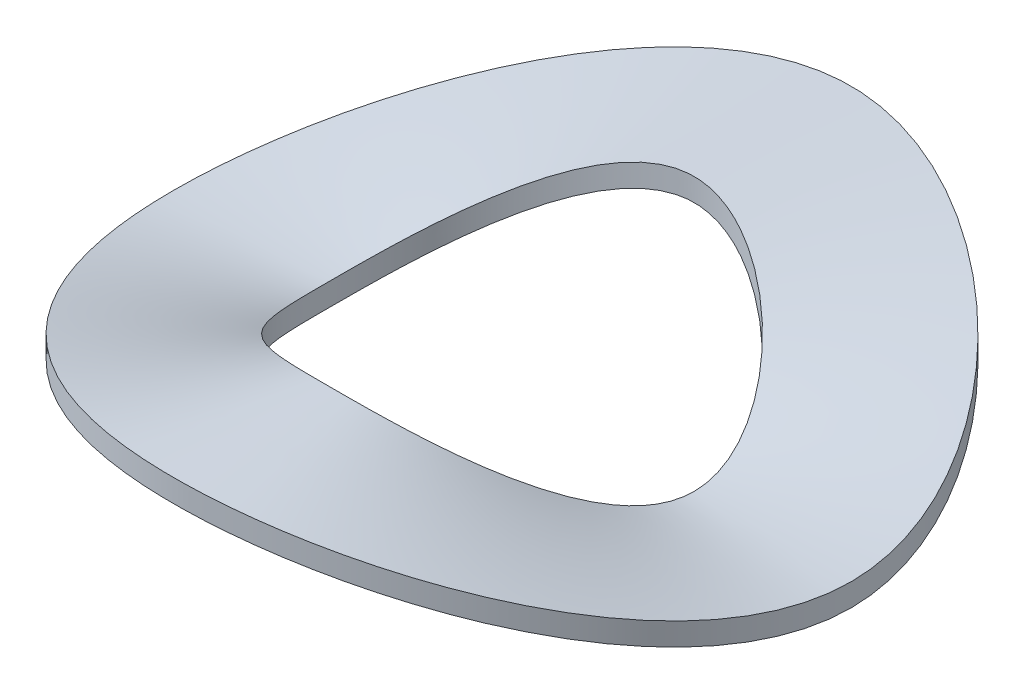
ISO-10303-21;
HEADER;
FILE_DESCRIPTION(('STEP AP214'),'2;1');
FILE_NAME('part.step','',(''),(''),'','','');
FILE_SCHEMA(('AUTOMOTIVE_DESIGN { 1 0 10303 214 1 1 1 1 }'));
ENDSEC;
DATA;
#1=APPLICATION_CONTEXT('core data for automotive mechanical design processes');
#2=APPLICATION_PROTOCOL_DEFINITION('international standard','automotive_design',2000,#1);
#3=PRODUCT_CONTEXT('',#1,'mechanical');
#4=PRODUCT('Part','Part','',(#3));
#5=PRODUCT_RELATED_PRODUCT_CATEGORY('part','',(#4));
#6=PRODUCT_DEFINITION_FORMATION('','',#4);
#7=PRODUCT_DEFINITION_CONTEXT('part definition',#1,'design');
#8=PRODUCT_DEFINITION('design','',#6,#7);
#9=PRODUCT_DEFINITION_SHAPE('','',#8);
#10=(LENGTH_UNIT() NAMED_UNIT(*) SI_UNIT(.MILLI.,.METRE.));
#11=(NAMED_UNIT(*) PLANE_ANGLE_UNIT() SI_UNIT($,.RADIAN.));
#12=(NAMED_UNIT(*) SI_UNIT($,.STERADIAN.) SOLID_ANGLE_UNIT());
#13=UNCERTAINTY_MEASURE_WITH_UNIT(LENGTH_MEASURE(1.E-05),#10,'distance_accuracy_value','');
#14=(GEOMETRIC_REPRESENTATION_CONTEXT(3) GLOBAL_UNCERTAINTY_ASSIGNED_CONTEXT((#13)) GLOBAL_UNIT_ASSIGNED_CONTEXT((#10,
#11,#12)) REPRESENTATION_CONTEXT('',''));
#15=CARTESIAN_POINT('',(0.,0.,0.));
#16=DIRECTION('',(0.,0.,1.));
#17=DIRECTION('',(1.,0.,0.));
#18=AXIS2_PLACEMENT_3D('',#15,#16,#17);
#19=CARTESIAN_POINT('',(-2.4511,0.304799999999994,0.));
#20=CARTESIAN_POINT('',(-2.45109999999954,0.304800000000202,-0.0612774999996929));
#21=CARTESIAN_POINT('',(-2.4449722499989,0.310896000000518,-0.183832499999086));
#22=CARTESIAN_POINT('',(-2.41831653749869,0.336499200000742,-0.366745837498236));
#23=CARTESIAN_POINT('',(-2.37511589999916,0.376732800000765,-0.547820849997448));
#24=CARTESIAN_POINT('',(-2.02215750000165,0.694944000003361,-1.61772600000511));
#25=CARTESIAN_POINT('',(0.245109999948093,2.49935999999959,-3.43153999999938));
#26=CARTESIAN_POINT('',(3.67665000001852,-0.91439999998158,-1.53592416562987E-11));
#27=CARTESIAN_POINT('',(0.245109999918596,2.49936000000041,3.43153999999816));
#28=CARTESIAN_POINT('',(-2.02215750002205,0.694943999996631,1.61772600001525));
#29=CARTESIAN_POINT('',(-2.3751159000074,0.37673279999717,0.547820849997112));
#30=CARTESIAN_POINT('',(-2.4183165375042,0.336499199998314,0.366745837498086));
#31=CARTESIAN_POINT('',(-2.44497225000166,0.310895999999297,0.183832499999058));
#32=CARTESIAN_POINT('',(-2.45110000000046,0.3047999999998,0.0612774999996929));
#33=CARTESIAN_POINT('',(-2.4511,0.304799999999994,0.));
#34=CARTESIAN_POINT('',(-2.4511,0.279399999999999,0.));
#35=CARTESIAN_POINT('',(-2.45109999999954,0.279400000000207,-0.0612774999996929));
#36=CARTESIAN_POINT('',(-2.4449722499989,0.285496000000524,-0.183832499999086));
#37=CARTESIAN_POINT('',(-2.41831653749869,0.311099200000747,-0.366745837498236));
#38=CARTESIAN_POINT('',(-2.37511589999916,0.35133280000077,-0.547820849997448));
#39=CARTESIAN_POINT('',(-2.02215750000165,0.669544000003366,-1.61772600000511));
#40=CARTESIAN_POINT('',(0.245109999948093,2.47395999999959,-3.43153999999938));
#41=CARTESIAN_POINT('',(3.67665000001852,-0.939799999981575,-1.53592416562987E-11));
#42=CARTESIAN_POINT('',(0.245109999918596,2.47396000000041,3.43153999999816));
#43=CARTESIAN_POINT('',(-2.02215750002205,0.669543999996636,1.61772600001525));
#44=CARTESIAN_POINT('',(-2.3751159000074,0.351332799997175,0.547820849997112));
#45=CARTESIAN_POINT('',(-2.4183165375042,0.311099199998319,0.366745837498086));
#46=CARTESIAN_POINT('',(-2.44497225000166,0.285495999999302,0.183832499999058));
#47=CARTESIAN_POINT('',(-2.45110000000046,0.279399999999791,0.0612774999996929));
#48=CARTESIAN_POINT('',(-2.4511,0.279399999999999,0.));
#49=CARTESIAN_POINT('',(-2.4511,0.228599999999995,0.));
#50=CARTESIAN_POINT('',(-2.45109999999955,0.228600000000204,-0.0612774999996929));
#51=CARTESIAN_POINT('',(-2.4449722499989,0.23469600000052,-0.183832499999086));
#52=CARTESIAN_POINT('',(-2.41831653749869,0.260299200000744,-0.366745837498236));
#53=CARTESIAN_POINT('',(-2.37511589999916,0.300532800000766,-0.547820849997452));
#54=CARTESIAN_POINT('',(-2.02215750000165,0.618744000003363,-1.61772600000511));
#55=CARTESIAN_POINT('',(0.245109999948093,2.42315999999959,-3.43153999999938));
#56=CARTESIAN_POINT('',(3.67665000001852,-0.990599999981578,-1.53592416562987E-11));
#57=CARTESIAN_POINT('',(0.245109999918596,2.42316000000041,3.43153999999817));
#58=CARTESIAN_POINT('',(-2.02215750002206,0.618743999996632,1.61772600001526));
#59=CARTESIAN_POINT('',(-2.3751159000074,0.300532799997172,0.547820849997112));
#60=CARTESIAN_POINT('',(-2.4183165375042,0.260299199998315,0.366745837498086));
#61=CARTESIAN_POINT('',(-2.44497225000166,0.234695999999299,0.183832499999058));
#62=CARTESIAN_POINT('',(-2.45110000000047,0.228599999999801,0.0612774999996929));
#63=CARTESIAN_POINT('',(-2.4511,0.228599999999995,0.));
#64=CARTESIAN_POINT('',(-2.4511,0.152399999999997,0.));
#65=CARTESIAN_POINT('',(-2.45109999999954,0.152400000000205,-0.0612774999996929));
#66=CARTESIAN_POINT('',(-2.44497224999889,0.158496000000521,-0.183832499999086));
#67=CARTESIAN_POINT('',(-2.41831653749869,0.184099200000745,-0.366745837498236));
#68=CARTESIAN_POINT('',(-2.37511589999916,0.224332800000768,-0.547820849997448));
#69=CARTESIAN_POINT('',(-2.02215750000165,0.542544000003364,-1.61772600000511));
#70=CARTESIAN_POINT('',(0.245109999948093,2.34695999999959,-3.43153999999937));
#71=CARTESIAN_POINT('',(3.67665000001852,-1.06679999998158,-1.53592416562987E-11));
#72=CARTESIAN_POINT('',(0.245109999918596,2.34696000000041,3.43153999999815));
#73=CARTESIAN_POINT('',(-2.02215750002205,0.542543999996634,1.61772600001525));
#74=CARTESIAN_POINT('',(-2.37511590000739,0.224332799997173,0.547820849997112));
#75=CARTESIAN_POINT('',(-2.4183165375042,0.184099199998317,0.366745837498079));
#76=CARTESIAN_POINT('',(-2.44497225000166,0.1584959999993,0.183832499999058));
#77=CARTESIAN_POINT('',(-2.45110000000046,0.152399999999803,0.0612774999996929));
#78=CARTESIAN_POINT('',(-2.4511,0.152399999999997,0.));
#79=CARTESIAN_POINT('',(-2.4511,0.0761999999999985,0.));
#80=CARTESIAN_POINT('',(-2.45109999999955,0.0762000000002067,-0.0612774999996929));
#81=CARTESIAN_POINT('',(-2.4449722499989,0.082296000000523,-0.183832499999086));
#82=CARTESIAN_POINT('',(-2.41831653749869,0.107899200000747,-0.366745837498236));
#83=CARTESIAN_POINT('',(-2.37511589999916,0.148132800000769,-0.547820849997452));
#84=CARTESIAN_POINT('',(-2.02215750000165,0.466344000003366,-1.61772600000511));
#85=CARTESIAN_POINT('',(0.245109999948093,2.27075999999959,-3.43153999999938));
#86=CARTESIAN_POINT('',(3.67665000001852,-1.14299999998158,-1.53592416562987E-11));
#87=CARTESIAN_POINT('',(0.245109999918596,2.27076000000041,3.43153999999817));
#88=CARTESIAN_POINT('',(-2.02215750002206,0.466343999996635,1.61772600001526));
#89=CARTESIAN_POINT('',(-2.3751159000074,0.148132799997175,0.547820849997112));
#90=CARTESIAN_POINT('',(-2.4183165375042,0.107899199998318,0.366745837498086));
#91=CARTESIAN_POINT('',(-2.44497225000166,0.0822959999993017,0.183832499999058));
#92=CARTESIAN_POINT('',(-2.45110000000047,0.0761999999997903,0.0612774999996929));
#93=CARTESIAN_POINT('',(-2.4511,0.0761999999999985,0.));
#94=CARTESIAN_POINT('',(-2.4511,0.0253999999999949,0.));
#95=CARTESIAN_POINT('',(-2.45109999999954,0.025400000000203,-0.0612774999996929));
#96=CARTESIAN_POINT('',(-2.4449722499989,0.0314960000005193,-0.183832499999086));
#97=CARTESIAN_POINT('',(-2.41831653749869,0.0570992000007431,-0.366745837498236));
#98=CARTESIAN_POINT('',(-2.37511589999916,0.0973328000007656,-0.547820849997448));
#99=CARTESIAN_POINT('',(-2.02215750000165,0.415544000003362,-1.61772600000511));
#100=CARTESIAN_POINT('',(0.245109999948093,2.21995999999959,-3.43153999999938));
#101=CARTESIAN_POINT('',(3.67665000001852,-1.19379999998158,-1.53592416562987E-11));
#102=CARTESIAN_POINT('',(0.245109999918596,2.21996000000041,3.43153999999816));
#103=CARTESIAN_POINT('',(-2.02215750002205,0.415543999996631,1.61772600001525));
#104=CARTESIAN_POINT('',(-2.3751159000074,0.0973327999971713,0.547820849997112));
#105=CARTESIAN_POINT('',(-2.4183165375042,0.0570991999983284,0.366745837498086));
#106=CARTESIAN_POINT('',(-2.44497225000166,0.0314959999992981,0.183832499999058));
#107=CARTESIAN_POINT('',(-2.45110000000046,0.0253999999998006,0.0612774999996929));
#108=CARTESIAN_POINT('',(-2.4511,0.0253999999999949,0.));
#109=CARTESIAN_POINT('',(-2.4511,0.,0.));
#110=CARTESIAN_POINT('',(-2.45109999999954,2.08166817117217E-13,-0.0612774999996929));
#111=CARTESIAN_POINT('',(-2.4449722499989,0.00609600000052446,-0.183832499999086));
#112=CARTESIAN_POINT('',(-2.41831653749869,0.0316992000007482,-0.366745837498236));
#113=CARTESIAN_POINT('',(-2.37511589999916,0.0719328000007707,-0.547820849997448));
#114=CARTESIAN_POINT('',(-2.02215750000165,0.390144000003367,-1.61772600000511));
#115=CARTESIAN_POINT('',(0.245109999948093,2.1945599999996,-3.43153999999938));
#116=CARTESIAN_POINT('',(3.67665000001852,-1.21919999998157,-1.53592416562987E-11));
#117=CARTESIAN_POINT('',(0.245109999918596,2.19456000000041,3.43153999999816));
#118=CARTESIAN_POINT('',(-2.02215750002205,0.390143999996637,1.61772600001525));
#119=CARTESIAN_POINT('',(-2.3751159000074,0.0719327999971764,0.547820849997112));
#120=CARTESIAN_POINT('',(-2.4183165375042,0.0316991999983196,0.366745837498086));
#121=CARTESIAN_POINT('',(-2.44497225000166,0.00609599999928934,0.183832499999058));
#122=CARTESIAN_POINT('',(-2.45110000000046,-2.08166817117217E-13,0.0612774999996929));
#123=CARTESIAN_POINT('',(-2.4511,0.,0.));
#124=B_SPLINE_SURFACE_WITH_KNOTS('',3,3,((#19,#20,#21,#22,#23,#24,#25,#26,#27,#28,#29,#30,#31,
#32,#33),(#34,#35,#36,#37,#38,#39,#40,#41,#42,#43,#44,#45,#46,#47,#48),(#49,#50,#51,#52,#53,#54,
#55,#56,#57,#58,#59,#60,#61,#62,#63),(#64,#65,#66,#67,#68,#69,#70,#71,#72,#73,#74,#75,#76,#77,
#78),(#79,#80,#81,#82,#83,#84,#85,#86,#87,#88,#89,#90,#91,#92,#93),(#94,#95,#96,#97,#98,#99,
#100,#101,#102,#103,#104,#105,#106,#107,#108),(#109,#110,#111,#112,#113,#114,#115,#116,#117,
#118,#119,#120,#121,#122,#123)),.UNSPECIFIED.,.F.,.T.,.F.,(4,1,1,1,4),(4,1,1,1,1,1,1,1,1,1,1,1,
4),(0.88785046728972,0.91588785046729,0.94392523364486,0.97196261682243,1.),(0.,0.0125,
0.0249999999999999,0.0375000000000001,0.05,0.250000000002523,0.5,0.749999999994969,0.95,0.9625,
0.975,0.9875,1.),.UNSPECIFIED.);
#125=CARTESIAN_POINT('',(-2.4511,0.,0.));
#126=CARTESIAN_POINT('',(-2.45109999999954,2.08166817117217E-13,-0.0612774999996929));
#127=CARTESIAN_POINT('',(-2.4449722499989,0.00609600000052446,-0.183832499999086));
#128=CARTESIAN_POINT('',(-2.41831653749869,0.0316992000007482,-0.366745837498236));
#129=CARTESIAN_POINT('',(-2.37511589999916,0.0719328000007707,-0.547820849997448));
#130=CARTESIAN_POINT('',(-2.02215750000165,0.390144000003367,-1.61772600000511));
#131=CARTESIAN_POINT('',(0.245109999948093,2.1945599999996,-3.43153999999938));
#132=CARTESIAN_POINT('',(3.67665000001852,-1.21919999998157,-1.53592416562987E-11));
#133=CARTESIAN_POINT('',(0.245109999918596,2.19456000000041,3.43153999999816));
#134=CARTESIAN_POINT('',(-2.02215750002205,0.390143999996637,1.61772600001525));
#135=CARTESIAN_POINT('',(-2.3751159000074,0.0719327999971764,0.547820849997112));
#136=CARTESIAN_POINT('',(-2.4183165375042,0.0316991999983196,0.366745837498086));
#137=CARTESIAN_POINT('',(-2.44497225000166,0.00609599999928934,0.183832499999058));
#138=CARTESIAN_POINT('',(-2.45110000000046,-2.08166817117217E-13,0.0612774999996929));
#139=CARTESIAN_POINT('',(-2.4511,0.,0.));
#140=B_SPLINE_CURVE_WITH_KNOTS('',3,(#125,#126,#127,#128,#129,#130,#131,#132,#133,#134,#135,
#136,#137,#138,#139),.UNSPECIFIED.,.T.,.F.,(4,1,1,1,1,1,1,1,1,1,1,1,4),(0.,0.0125,
0.0249999999999999,0.0375000000000001,0.05,0.250000000002523,0.5,0.749999999994969,0.95,0.9625,
0.975,0.9875,1.),.UNSPECIFIED.);
#141=CARTESIAN_POINT('',(-2.4511,0.,0.));
#142=VERTEX_POINT('',#141);
#143=EDGE_CURVE('E13',#142,#142,#140,.T.);
#144=CARTESIAN_POINT('',(-2.4511,0.304799999999994,0.));
#145=CARTESIAN_POINT('',(-2.45109999999954,0.304800000000202,-0.0612774999996929));
#146=CARTESIAN_POINT('',(-2.4449722499989,0.310896000000518,-0.183832499999086));
#147=CARTESIAN_POINT('',(-2.41831653749869,0.336499200000742,-0.366745837498236));
#148=CARTESIAN_POINT('',(-2.37511589999916,0.376732800000765,-0.547820849997448));
#149=CARTESIAN_POINT('',(-2.02215750000165,0.694944000003361,-1.61772600000511));
#150=CARTESIAN_POINT('',(0.245109999948093,2.49935999999959,-3.43153999999938));
#151=CARTESIAN_POINT('',(3.67665000001852,-0.91439999998158,-1.53592416562987E-11));
#152=CARTESIAN_POINT('',(0.245109999918596,2.49936000000041,3.43153999999816));
#153=CARTESIAN_POINT('',(-2.02215750002205,0.694943999996631,1.61772600001525));
#154=CARTESIAN_POINT('',(-2.3751159000074,0.37673279999717,0.547820849997112));
#155=CARTESIAN_POINT('',(-2.4183165375042,0.336499199998314,0.366745837498086));
#156=CARTESIAN_POINT('',(-2.44497225000166,0.310895999999297,0.183832499999058));
#157=CARTESIAN_POINT('',(-2.45110000000046,0.3047999999998,0.0612774999996929));
#158=CARTESIAN_POINT('',(-2.4511,0.304799999999994,0.));
#159=B_SPLINE_CURVE_WITH_KNOTS('',3,(#144,#145,#146,#147,#148,#149,#150,#151,#152,#153,#154,
#155,#156,#157,#158),.UNSPECIFIED.,.T.,.F.,(4,1,1,1,1,1,1,1,1,1,1,1,4),(0.,0.0125,
0.0249999999999999,0.0375000000000001,0.05,0.250000000002523,0.5,0.749999999994969,0.95,0.9625,
0.975,0.9875,1.),.UNSPECIFIED.);
#160=CARTESIAN_POINT('',(-2.4511,0.304799999999994,0.));
#161=VERTEX_POINT('',#160);
#162=EDGE_CURVE('E69',#161,#161,#159,.T.);
#163=ORIENTED_EDGE('',*,*,#143,.T.);
#164=EDGE_LOOP('',(#163));
#165=FACE_BOUND('',#164,.T.);
#166=ORIENTED_EDGE('',*,*,#162,.F.);
#167=EDGE_LOOP('',(#166));
#168=FACE_BOUND('',#167,.T.);
#169=ADVANCED_FACE('F58',(#165,#168),#124,.T.);
#170=CARTESIAN_POINT('',(-4.5593,0.304799999999994,0.));
#171=CARTESIAN_POINT('',(-4.55929999999914,0.304800000000202,-0.113982499999422));
#172=CARTESIAN_POINT('',(-4.54790174999794,0.310896000000518,-0.341947499998302));
#173=CARTESIAN_POINT('',(-4.49831936249755,0.336499200000742,-0.682185262496724));
#174=CARTESIAN_POINT('',(-4.41796169999843,0.376732800000765,-1.01900354999525));
#175=CARTESIAN_POINT('',(-3.76142250000307,0.694944000003361,-3.00913800000951));
#176=CARTESIAN_POINT('',(0.455929999903446,2.49935999999959,-6.38301999999885));
#177=CARTESIAN_POINT('',(6.83895000003444,-0.91439999998158,-2.857436509629E-11));
#178=CARTESIAN_POINT('',(0.45592999984858,2.49936000000041,6.38301999999657));
#179=CARTESIAN_POINT('',(-3.76142250004102,0.694943999996631,3.00913800002837));
#180=CARTESIAN_POINT('',(-4.41796170001376,0.37673279999717,1.01900354999461));
#181=CARTESIAN_POINT('',(-4.49831936250782,0.336499199998314,0.68218526249644));
#182=CARTESIAN_POINT('',(-4.54790175000309,0.310895999999297,0.34194749999825));
#183=CARTESIAN_POINT('',(-4.55930000000086,0.3047999999998,0.113982499999433));
#184=CARTESIAN_POINT('',(-4.5593,0.304799999999994,0.));
#185=CARTESIAN_POINT('',(-4.38361666666666,0.304799999999994,0.));
#186=CARTESIAN_POINT('',(-4.38361666666584,0.304800000000202,-0.109590416666114));
#187=CARTESIAN_POINT('',(-4.37265762499802,0.310896000000518,-0.328771249998368));
#188=CARTESIAN_POINT('',(-4.32498579374765,0.336499200000742,-0.655898643746846));
#189=CARTESIAN_POINT('',(-4.24772454999849,0.376732800000765,-0.979738324995438));
#190=CARTESIAN_POINT('',(-3.61648375000295,0.694944000003361,-2.89318700000915));
#191=CARTESIAN_POINT('',(0.438361666573833,2.49935999999959,-6.13706333333222));
#192=CARTESIAN_POINT('',(6.57542500003311,-0.91439999998158,-2.74710809655687E-11));
#193=CARTESIAN_POINT('',(0.438361666521083,2.49936000000041,6.13706333333003));
#194=CARTESIAN_POINT('',(-3.61648375003944,0.694943999996631,2.89318700002728));
#195=CARTESIAN_POINT('',(-4.24772455001323,0.37673279999717,0.979738324994827));
#196=CARTESIAN_POINT('',(-4.32498579375752,0.336499199998314,0.655898643746575));
#197=CARTESIAN_POINT('',(-4.37265762500297,0.310895999999297,0.328771249998319));
#198=CARTESIAN_POINT('',(-4.38361666666749,0.3047999999998,0.109590416666118));
#199=CARTESIAN_POINT('',(-4.38361666666666,0.304799999999994,0.));
#200=CARTESIAN_POINT('',(-4.03225,0.304799999999994,0.));
#201=CARTESIAN_POINT('',(-4.03224999999924,0.304800000000202,-0.100806249999488));
#202=CARTESIAN_POINT('',(-4.02216937499818,0.310896000000518,-0.3024187499985));
#203=CARTESIAN_POINT('',(-3.97831865624784,0.336499200000742,-0.603325406247104));
#204=CARTESIAN_POINT('',(-3.90725024999861,0.376732800000765,-0.901207874995803));
#205=CARTESIAN_POINT('',(-3.32660625000271,0.694944000003361,-2.66128500000841));
#206=CARTESIAN_POINT('',(0.403224999914607,2.49935999999959,-5.64514999999898));
#207=CARTESIAN_POINT('',(6.04837500003046,-0.91439999998158,-2.52714515980301E-11));
#208=CARTESIAN_POINT('',(0.403224999866083,2.49936000000041,5.64514999999696));
#209=CARTESIAN_POINT('',(-3.32660625003628,0.694943999996631,2.6612850000251));
#210=CARTESIAN_POINT('',(-3.90725025001217,0.37673279999717,0.901207874995237));
#211=CARTESIAN_POINT('',(-3.97831865625692,0.336499199998314,0.60332540624685));
#212=CARTESIAN_POINT('',(-4.02216937500273,0.310895999999297,0.302418749998451));
#213=CARTESIAN_POINT('',(-4.03225000000076,0.3047999999998,0.100806249999495));
#214=CARTESIAN_POINT('',(-4.03225,0.304799999999994,0.));
#215=CARTESIAN_POINT('',(-3.5052,0.304799999999994,0.));
#216=CARTESIAN_POINT('',(-3.50519999999934,0.304800000000202,-0.0876299999995576));
#217=CARTESIAN_POINT('',(-3.49643699999842,0.310896000000518,-0.262889999998697));
#218=CARTESIAN_POINT('',(-3.45831794999812,0.336499200000756,-0.52446554999748));
#219=CARTESIAN_POINT('',(-3.39653879999879,0.376732800000765,-0.78341219999635));
#220=CARTESIAN_POINT('',(-2.89179000000235,0.694944000003361,-2.31343200000731));
#221=CARTESIAN_POINT('',(0.350519999925771,2.49935999999959,-4.90727999999911));
#222=CARTESIAN_POINT('',(5.25780000002648,-0.91439999998158,-2.19685380997703E-11));
#223=CARTESIAN_POINT('',(0.35051999988359,2.49936000000041,4.90727999999736));
#224=CARTESIAN_POINT('',(-2.89179000003153,0.694943999996631,2.31343200002181));
#225=CARTESIAN_POINT('',(-3.39653880001058,0.37673279999717,0.783412199995864));
#226=CARTESIAN_POINT('',(-3.45831795000601,0.336499199998314,0.524465549997258));
#227=CARTESIAN_POINT('',(-3.49643700000237,0.310895999999297,0.262889999998656));
#228=CARTESIAN_POINT('',(-3.50520000000066,0.3047999999998,0.0876299999995611));
#229=CARTESIAN_POINT('',(-3.5052,0.304799999999994,0.));
#230=CARTESIAN_POINT('',(-2.97815,0.304799999999994,0.));
#231=CARTESIAN_POINT('',(-2.97814999999944,0.304800000000202,-0.0744537499996201));
#232=CARTESIAN_POINT('',(-2.97070462499865,0.310896000000518,-0.223361249998891));
#233=CARTESIAN_POINT('',(-2.9383172437484,0.336499200000742,-0.445605693747859));
#234=CARTESIAN_POINT('',(-2.88582734999897,0.376732800000765,-0.665616524996897));
#235=CARTESIAN_POINT('',(-2.456973750002,0.694944000003361,-1.96557900000621));
#236=CARTESIAN_POINT('',(0.297814999936932,2.49935999999959,-4.16940999999925));
#237=CARTESIAN_POINT('',(4.46722500002249,-0.91439999998158,-1.86586857076065E-11));
#238=CARTESIAN_POINT('',(0.297814999901093,2.49936000000041,4.16940999999776));
#239=CARTESIAN_POINT('',(-2.45697375002679,0.694943999996631,1.96557900001854));
#240=CARTESIAN_POINT('',(-2.88582735000899,0.37673279999717,0.665616524996485));
#241=CARTESIAN_POINT('',(-2.9383172437551,0.336499199998314,0.445605693747672));
#242=CARTESIAN_POINT('',(-2.97070462500201,0.310895999999297,0.223361249998853));
#243=CARTESIAN_POINT('',(-2.97815000000056,0.3047999999998,0.074453749999627));
#244=CARTESIAN_POINT('',(-2.97815,0.304799999999994,0.));
#245=CARTESIAN_POINT('',(-2.62678333333333,0.304799999999994,0.));
#246=CARTESIAN_POINT('',(-2.62678333333284,0.304800000000202,-0.0656695833329973));
#247=CARTESIAN_POINT('',(-2.62021637499881,0.310896000000518,-0.197008749999023));
#248=CARTESIAN_POINT('',(-2.59165010624859,0.336499200000742,-0.39303245624811));
#249=CARTESIAN_POINT('',(-2.5453530499991,0.376732800000765,-0.587086074997262));
#250=CARTESIAN_POINT('',(-2.16709625000177,0.694944000003361,-1.73367700000548));
#251=CARTESIAN_POINT('',(0.262678333277706,2.49935999999959,-3.677496666666));
#252=CARTESIAN_POINT('',(3.94017500001984,-0.91439999998158,-1.6455586893116E-11));
#253=CARTESIAN_POINT('',(0.262678333246096,2.49936000000041,3.67749666666469));
#254=CARTESIAN_POINT('',(-2.16709625002363,0.694943999996631,1.73367700001635));
#255=CARTESIAN_POINT('',(-2.54535305000792,0.37673279999717,0.587086074996898));
#256=CARTESIAN_POINT('',(-2.59165010625451,0.336499199998314,0.393032456247951));
#257=CARTESIAN_POINT('',(-2.62021637500178,0.310895999999297,0.197008749998992));
#258=CARTESIAN_POINT('',(-2.62678333333383,0.3047999999998,0.0656695833330043));
#259=CARTESIAN_POINT('',(-2.62678333333333,0.304799999999994,0.));
#260=CARTESIAN_POINT('',(-2.4511,0.304799999999994,0.));
#261=CARTESIAN_POINT('',(-2.45109999999954,0.304800000000202,-0.0612774999996929));
#262=CARTESIAN_POINT('',(-2.4449722499989,0.310896000000518,-0.183832499999086));
#263=CARTESIAN_POINT('',(-2.41831653749869,0.336499200000742,-0.366745837498236));
#264=CARTESIAN_POINT('',(-2.37511589999916,0.376732800000765,-0.547820849997448));
#265=CARTESIAN_POINT('',(-2.02215750000165,0.694944000003361,-1.61772600000511));
#266=CARTESIAN_POINT('',(0.245109999948093,2.49935999999959,-3.43153999999938));
#267=CARTESIAN_POINT('',(3.67665000001852,-0.91439999998158,-1.53592416562987E-11));
#268=CARTESIAN_POINT('',(0.245109999918596,2.49936000000041,3.43153999999816));
#269=CARTESIAN_POINT('',(-2.02215750002205,0.694943999996631,1.61772600001525));
#270=CARTESIAN_POINT('',(-2.3751159000074,0.37673279999717,0.547820849997112));
#271=CARTESIAN_POINT('',(-2.4183165375042,0.336499199998314,0.366745837498086));
#272=CARTESIAN_POINT('',(-2.44497225000166,0.310895999999297,0.183832499999058));
#273=CARTESIAN_POINT('',(-2.45110000000046,0.3047999999998,0.0612774999996929));
#274=CARTESIAN_POINT('',(-2.4511,0.304799999999994,0.));
#275=B_SPLINE_SURFACE_WITH_KNOTS('',3,3,((#170,#171,#172,#173,#174,#175,#176,#177,#178,#179,
#180,#181,#182,#183,#184),(#185,#186,#187,#188,#189,#190,#191,#192,#193,#194,#195,#196,#197,
#198,#199),(#200,#201,#202,#203,#204,#205,#206,#207,#208,#209,#210,#211,#212,#213,#214),(#215,
#216,#217,#218,#219,#220,#221,#222,#223,#224,#225,#226,#227,#228,#229),(#230,#231,#232,#233,
#234,#235,#236,#237,#238,#239,#240,#241,#242,#243,#244),(#245,#246,#247,#248,#249,#250,#251,
#252,#253,#254,#255,#256,#257,#258,#259),(#260,#261,#262,#263,#264,#265,#266,#267,#268,#269,
#270,#271,#272,#273,#274)),.UNSPECIFIED.,.F.,.T.,.F.,(4,1,1,1,4),(4,1,1,1,1,1,1,1,1,1,1,1,4),
(0.11214953271028,0.30607476635514,0.5,0.69392523364486,0.88785046728972),(0.,0.0125,
0.0249999999999999,0.0375000000000001,0.05,0.250000000002523,0.5,0.749999999994969,0.95,0.9625,
0.975,0.9875,1.),.UNSPECIFIED.);
#276=CARTESIAN_POINT('',(-4.5593,0.304799999999994,0.));
#277=CARTESIAN_POINT('',(-4.55929999999914,0.304800000000202,-0.113982499999422));
#278=CARTESIAN_POINT('',(-4.54790174999794,0.310896000000518,-0.341947499998302));
#279=CARTESIAN_POINT('',(-4.49831936249755,0.336499200000742,-0.682185262496724));
#280=CARTESIAN_POINT('',(-4.41796169999843,0.376732800000765,-1.01900354999525));
#281=CARTESIAN_POINT('',(-3.76142250000307,0.694944000003361,-3.00913800000951));
#282=CARTESIAN_POINT('',(0.455929999903446,2.49935999999959,-6.38301999999885));
#283=CARTESIAN_POINT('',(6.83895000003444,-0.91439999998158,-2.857436509629E-11));
#284=CARTESIAN_POINT('',(0.45592999984858,2.49936000000041,6.38301999999657));
#285=CARTESIAN_POINT('',(-3.76142250004102,0.694943999996631,3.00913800002837));
#286=CARTESIAN_POINT('',(-4.41796170001376,0.37673279999717,1.01900354999461));
#287=CARTESIAN_POINT('',(-4.49831936250782,0.336499199998314,0.68218526249644));
#288=CARTESIAN_POINT('',(-4.54790175000309,0.310895999999297,0.34194749999825));
#289=CARTESIAN_POINT('',(-4.55930000000086,0.3047999999998,0.113982499999433));
#290=CARTESIAN_POINT('',(-4.5593,0.304799999999994,0.));
#291=B_SPLINE_CURVE_WITH_KNOTS('',3,(#276,#277,#278,#279,#280,#281,#282,#283,#284,#285,#286,
#287,#288,#289,#290),.UNSPECIFIED.,.T.,.F.,(4,1,1,1,1,1,1,1,1,1,1,1,4),(0.,0.0125,
0.0249999999999999,0.0375000000000001,0.05,0.250000000002523,0.5,0.749999999994969,0.95,0.9625,
0.975,0.9875,1.),.UNSPECIFIED.);
#292=CARTESIAN_POINT('',(-4.5593,0.304799999999994,0.));
#293=VERTEX_POINT('',#292);
#294=EDGE_CURVE('E73',#293,#293,#291,.T.);
#295=ORIENTED_EDGE('',*,*,#162,.T.);
#296=EDGE_LOOP('',(#295));
#297=FACE_BOUND('',#296,.T.);
#298=ORIENTED_EDGE('',*,*,#294,.F.);
#299=EDGE_LOOP('',(#298));
#300=FACE_BOUND('',#299,.T.);
#301=ADVANCED_FACE('F101',(#297,#300),#275,.T.);
#302=CARTESIAN_POINT('',(-4.5593,0.,0.));
#303=CARTESIAN_POINT('',(-4.55929999999914,2.08166817117217E-13,-0.113982499999422));
#304=CARTESIAN_POINT('',(-4.54790174999794,0.00609600000052446,-0.341947499998302));
#305=CARTESIAN_POINT('',(-4.49831936249755,0.0316992000007482,-0.682185262496724));
#306=CARTESIAN_POINT('',(-4.41796169999843,0.0719328000007707,-1.01900354999525));
#307=CARTESIAN_POINT('',(-3.76142250000307,0.390144000003367,-3.00913800000951));
#308=CARTESIAN_POINT('',(0.455929999903446,2.1945599999996,-6.38301999999885));
#309=CARTESIAN_POINT('',(6.83895000003444,-1.21919999998157,-2.85674262023861E-11));
#310=CARTESIAN_POINT('',(0.45592999984858,2.19456000000041,6.38301999999657));
#311=CARTESIAN_POINT('',(-3.76142250004102,0.390143999996637,3.00913800002837));
#312=CARTESIAN_POINT('',(-4.41796170001376,0.0719327999971764,1.01900354999461));
#313=CARTESIAN_POINT('',(-4.49831936250782,0.0316991999983196,0.68218526249644));
#314=CARTESIAN_POINT('',(-4.54790175000309,0.00609599999928934,0.34194749999825));
#315=CARTESIAN_POINT('',(-4.55930000000086,-2.08166817117217E-13,0.113982499999433));
#316=CARTESIAN_POINT('',(-4.5593,0.,0.));
#317=CARTESIAN_POINT('',(-4.5593,0.0253999999999949,0.));
#318=CARTESIAN_POINT('',(-4.55929999999914,0.025400000000203,-0.113982499999422));
#319=CARTESIAN_POINT('',(-4.54790174999794,0.0314960000005193,-0.341947499998302));
#320=CARTESIAN_POINT('',(-4.49831936249755,0.0570992000007431,-0.682185262496724));
#321=CARTESIAN_POINT('',(-4.41796169999843,0.0973328000007656,-1.01900354999525));
#322=CARTESIAN_POINT('',(-3.76142250000307,0.415544000003362,-3.00913800000951));
#323=CARTESIAN_POINT('',(0.455929999903446,2.21995999999959,-6.38301999999885));
#324=CARTESIAN_POINT('',(6.83895000003444,-1.19379999998158,-2.857436509629E-11));
#325=CARTESIAN_POINT('',(0.45592999984858,2.21996000000041,6.38301999999657));
#326=CARTESIAN_POINT('',(-3.76142250004102,0.415543999996631,3.00913800002837));
#327=CARTESIAN_POINT('',(-4.41796170001376,0.0973327999971713,1.01900354999461));
#328=CARTESIAN_POINT('',(-4.49831936250782,0.0570991999983284,0.68218526249644));
#329=CARTESIAN_POINT('',(-4.54790175000309,0.0314959999992981,0.34194749999825));
#330=CARTESIAN_POINT('',(-4.55930000000086,0.0253999999998006,0.113982499999433));
#331=CARTESIAN_POINT('',(-4.5593,0.0253999999999949,0.));
#332=CARTESIAN_POINT('',(-4.5593,0.0761999999999985,0.));
#333=CARTESIAN_POINT('',(-4.55929999999914,0.0762000000002067,-0.113982499999422));
#334=CARTESIAN_POINT('',(-4.54790174999795,0.082296000000523,-0.341947499998302));
#335=CARTESIAN_POINT('',(-4.49831936249756,0.107899200000747,-0.682185262496724));
#336=CARTESIAN_POINT('',(-4.41796169999843,0.148132800000769,-1.01900354999525));
#337=CARTESIAN_POINT('',(-3.76142250000307,0.466344000003366,-3.00913800000951));
#338=CARTESIAN_POINT('',(0.455929999903442,2.27075999999959,-6.38301999999885));
#339=CARTESIAN_POINT('',(6.83895000003445,-1.14299999998158,-2.857436509629E-11));
#340=CARTESIAN_POINT('',(0.45592999984858,2.27076000000041,6.38301999999658));
#341=CARTESIAN_POINT('',(-3.76142250004102,0.466343999996635,3.00913800002837));
#342=CARTESIAN_POINT('',(-4.41796170001377,0.148132799997175,1.01900354999462));
#343=CARTESIAN_POINT('',(-4.49831936250782,0.107899199998318,0.68218526249644));
#344=CARTESIAN_POINT('',(-4.54790175000309,0.0822959999993017,0.34194749999825));
#345=CARTESIAN_POINT('',(-4.55930000000086,0.0761999999997903,0.113982499999433));
#346=CARTESIAN_POINT('',(-4.5593,0.0761999999999985,0.));
#347=CARTESIAN_POINT('',(-4.55929999999999,0.152399999999997,0.));
#348=CARTESIAN_POINT('',(-4.55929999999914,0.152400000000205,-0.113982499999422));
#349=CARTESIAN_POINT('',(-4.54790174999794,0.158496000000521,-0.341947499998302));
#350=CARTESIAN_POINT('',(-4.49831936249755,0.184099200000745,-0.682185262496724));
#351=CARTESIAN_POINT('',(-4.41796169999843,0.224332800000768,-1.01900354999525));
#352=CARTESIAN_POINT('',(-3.76142250000306,0.542544000003364,-3.0091380000095));
#353=CARTESIAN_POINT('',(0.455929999903446,2.34695999999959,-6.38301999999883));
#354=CARTESIAN_POINT('',(6.83895000003443,-1.06679999998158,-2.85674262023861E-11));
#355=CARTESIAN_POINT('',(0.455929999848583,2.3469600000004,6.38301999999656));
#356=CARTESIAN_POINT('',(-3.76142250004102,0.542543999996634,3.00913800002837));
#357=CARTESIAN_POINT('',(-4.41796170001376,0.224332799997173,1.01900354999461));
#358=CARTESIAN_POINT('',(-4.49831936250782,0.184099199998317,0.682185262496433));
#359=CARTESIAN_POINT('',(-4.54790175000309,0.1584959999993,0.34194749999825));
#360=CARTESIAN_POINT('',(-4.55930000000085,0.152399999999803,0.113982499999426));
#361=CARTESIAN_POINT('',(-4.55929999999999,0.152399999999997,0.));
#362=CARTESIAN_POINT('',(-4.5593,0.228599999999995,0.));
#363=CARTESIAN_POINT('',(-4.55929999999914,0.228600000000204,-0.113982499999422));
#364=CARTESIAN_POINT('',(-4.54790174999795,0.23469600000052,-0.341947499998298));
#365=CARTESIAN_POINT('',(-4.49831936249756,0.260299200000744,-0.682185262496724));
#366=CARTESIAN_POINT('',(-4.41796169999843,0.300532800000766,-1.01900354999525));
#367=CARTESIAN_POINT('',(-3.76142250000307,0.618744000003363,-3.00913800000951));
#368=CARTESIAN_POINT('',(0.455929999903446,2.42315999999959,-6.38301999999885));
#369=CARTESIAN_POINT('',(6.83895000003445,-0.990599999981578,-2.857436509629E-11));
#370=CARTESIAN_POINT('',(0.45592999984858,2.42316000000041,6.38301999999658));
#371=CARTESIAN_POINT('',(-3.76142250004102,0.618743999996632,3.00913800002837));
#372=CARTESIAN_POINT('',(-4.41796170001377,0.300532799997172,1.01900354999462));
#373=CARTESIAN_POINT('',(-4.49831936250782,0.260299199998315,0.68218526249644));
#374=CARTESIAN_POINT('',(-4.54790175000309,0.234695999999299,0.34194749999825));
#375=CARTESIAN_POINT('',(-4.55930000000086,0.228599999999801,0.113982499999433));
#376=CARTESIAN_POINT('',(-4.5593,0.228599999999995,0.));
#377=CARTESIAN_POINT('',(-4.5593,0.279399999999999,0.));
#378=CARTESIAN_POINT('',(-4.55929999999914,0.279400000000207,-0.113982499999422));
#379=CARTESIAN_POINT('',(-4.54790174999794,0.285496000000524,-0.341947499998302));
#380=CARTESIAN_POINT('',(-4.49831936249755,0.311099200000747,-0.682185262496724));
#381=CARTESIAN_POINT('',(-4.41796169999843,0.35133280000077,-1.01900354999525));
#382=CARTESIAN_POINT('',(-3.76142250000307,0.669544000003366,-3.00913800000951));
#383=CARTESIAN_POINT('',(0.455929999903446,2.47395999999959,-6.38301999999885));
#384=CARTESIAN_POINT('',(6.83895000003444,-0.939799999981575,-2.857436509629E-11));
#385=CARTESIAN_POINT('',(0.45592999984858,2.47396000000041,6.38301999999657));
#386=CARTESIAN_POINT('',(-3.76142250004102,0.669543999996636,3.00913800002837));
#387=CARTESIAN_POINT('',(-4.41796170001376,0.351332799997175,1.01900354999461));
#388=CARTESIAN_POINT('',(-4.49831936250782,0.311099199998319,0.68218526249644));
#389=CARTESIAN_POINT('',(-4.54790175000309,0.285495999999302,0.34194749999825));
#390=CARTESIAN_POINT('',(-4.55930000000086,0.279399999999791,0.113982499999433));
#391=CARTESIAN_POINT('',(-4.5593,0.279399999999999,0.));
#392=CARTESIAN_POINT('',(-4.5593,0.304799999999994,0.));
#393=CARTESIAN_POINT('',(-4.55929999999914,0.304800000000202,-0.113982499999422));
#394=CARTESIAN_POINT('',(-4.54790174999794,0.310896000000518,-0.341947499998302));
#395=CARTESIAN_POINT('',(-4.49831936249755,0.336499200000742,-0.682185262496724));
#396=CARTESIAN_POINT('',(-4.41796169999843,0.376732800000765,-1.01900354999525));
#397=CARTESIAN_POINT('',(-3.76142250000307,0.694944000003361,-3.00913800000951));
#398=CARTESIAN_POINT('',(0.455929999903446,2.49935999999959,-6.38301999999885));
#399=CARTESIAN_POINT('',(6.83895000003444,-0.91439999998158,-2.857436509629E-11));
#400=CARTESIAN_POINT('',(0.45592999984858,2.49936000000041,6.38301999999657));
#401=CARTESIAN_POINT('',(-3.76142250004102,0.694943999996631,3.00913800002837));
#402=CARTESIAN_POINT('',(-4.41796170001376,0.37673279999717,1.01900354999461));
#403=CARTESIAN_POINT('',(-4.49831936250782,0.336499199998314,0.68218526249644));
#404=CARTESIAN_POINT('',(-4.54790175000309,0.310895999999297,0.34194749999825));
#405=CARTESIAN_POINT('',(-4.55930000000086,0.3047999999998,0.113982499999433));
#406=CARTESIAN_POINT('',(-4.5593,0.304799999999994,0.));
#407=B_SPLINE_SURFACE_WITH_KNOTS('',3,3,((#302,#303,#304,#305,#306,#307,#308,#309,#310,#311,
#312,#313,#314,#315,#316),(#317,#318,#319,#320,#321,#322,#323,#324,#325,#326,#327,#328,#329,
#330,#331),(#332,#333,#334,#335,#336,#337,#338,#339,#340,#341,#342,#343,#344,#345,#346),(#347,
#348,#349,#350,#351,#352,#353,#354,#355,#356,#357,#358,#359,#360,#361),(#362,#363,#364,#365,
#366,#367,#368,#369,#370,#371,#372,#373,#374,#375,#376),(#377,#378,#379,#380,#381,#382,#383,
#384,#385,#386,#387,#388,#389,#390,#391),(#392,#393,#394,#395,#396,#397,#398,#399,#400,#401,
#402,#403,#404,#405,#406)),.UNSPECIFIED.,.F.,.T.,.F.,(4,1,1,1,4),(4,1,1,1,1,1,1,1,1,1,1,1,4),
(0.,0.0280373831775701,0.0560747663551402,0.0841121495327103,0.11214953271028),(0.,0.0125,
0.0249999999999999,0.0375000000000001,0.05,0.250000000002523,0.5,0.749999999994969,0.95,0.9625,
0.975,0.9875,1.),.UNSPECIFIED.);
#408=CARTESIAN_POINT('',(-4.5593,0.,0.));
#409=CARTESIAN_POINT('',(-4.55929999999914,2.08166817117217E-13,-0.113982499999422));
#410=CARTESIAN_POINT('',(-4.54790174999794,0.00609600000052446,-0.341947499998302));
#411=CARTESIAN_POINT('',(-4.49831936249755,0.0316992000007482,-0.682185262496724));
#412=CARTESIAN_POINT('',(-4.41796169999843,0.0719328000007707,-1.01900354999525));
#413=CARTESIAN_POINT('',(-3.76142250000307,0.390144000003367,-3.00913800000951));
#414=CARTESIAN_POINT('',(0.455929999903446,2.1945599999996,-6.38301999999885));
#415=CARTESIAN_POINT('',(6.83895000003444,-1.21919999998157,-2.85674262023861E-11));
#416=CARTESIAN_POINT('',(0.45592999984858,2.19456000000041,6.38301999999657));
#417=CARTESIAN_POINT('',(-3.76142250004102,0.390143999996637,3.00913800002837));
#418=CARTESIAN_POINT('',(-4.41796170001376,0.0719327999971764,1.01900354999461));
#419=CARTESIAN_POINT('',(-4.49831936250782,0.0316991999983196,0.68218526249644));
#420=CARTESIAN_POINT('',(-4.54790175000309,0.00609599999928934,0.34194749999825));
#421=CARTESIAN_POINT('',(-4.55930000000086,-2.08166817117217E-13,0.113982499999433));
#422=CARTESIAN_POINT('',(-4.5593,0.,0.));
#423=B_SPLINE_CURVE_WITH_KNOTS('',3,(#408,#409,#410,#411,#412,#413,#414,#415,#416,#417,#418,
#419,#420,#421,#422),.UNSPECIFIED.,.T.,.F.,(4,1,1,1,1,1,1,1,1,1,1,1,4),(0.,0.0125,
0.0249999999999999,0.0375000000000001,0.05,0.250000000002523,0.5,0.749999999994969,0.95,0.9625,
0.975,0.9875,1.),.UNSPECIFIED.);
#424=CARTESIAN_POINT('',(-4.5593,0.,0.));
#425=VERTEX_POINT('',#424);
#426=EDGE_CURVE('E77',#425,#425,#423,.T.);
#427=ORIENTED_EDGE('',*,*,#294,.T.);
#428=EDGE_LOOP('',(#427));
#429=FACE_BOUND('',#428,.T.);
#430=ORIENTED_EDGE('',*,*,#426,.F.);
#431=EDGE_LOOP('',(#430));
#432=FACE_BOUND('',#431,.T.);
#433=ADVANCED_FACE('F99',(#429,#432),#407,.T.);
#434=CARTESIAN_POINT('',(-2.4511,0.,0.));
#435=CARTESIAN_POINT('',(-2.45109999999954,2.08166817117217E-13,-0.0612774999996929));
#436=CARTESIAN_POINT('',(-2.4449722499989,0.00609600000052446,-0.183832499999086));
#437=CARTESIAN_POINT('',(-2.41831653749869,0.0316992000007482,-0.366745837498236));
#438=CARTESIAN_POINT('',(-2.37511589999916,0.0719328000007707,-0.547820849997448));
#439=CARTESIAN_POINT('',(-2.02215750000165,0.390144000003367,-1.61772600000511));
#440=CARTESIAN_POINT('',(0.245109999948093,2.1945599999996,-3.43153999999938));
#441=CARTESIAN_POINT('',(3.67665000001852,-1.21919999998157,-1.53592416562987E-11));
#442=CARTESIAN_POINT('',(0.245109999918596,2.19456000000041,3.43153999999816));
#443=CARTESIAN_POINT('',(-2.02215750002205,0.390143999996637,1.61772600001525));
#444=CARTESIAN_POINT('',(-2.3751159000074,0.0719327999971764,0.547820849997112));
#445=CARTESIAN_POINT('',(-2.4183165375042,0.0316991999983196,0.366745837498086));
#446=CARTESIAN_POINT('',(-2.44497225000166,0.00609599999928934,0.183832499999058));
#447=CARTESIAN_POINT('',(-2.45110000000046,-2.08166817117217E-13,0.0612774999996929));
#448=CARTESIAN_POINT('',(-2.4511,0.,0.));
#449=CARTESIAN_POINT('',(-3.15383333333333,0.,0.));
#450=CARTESIAN_POINT('',(-3.15383333333274,2.08166817117217E-13,-0.0788458333329314));
#451=CARTESIAN_POINT('',(-3.14594874999858,0.00609600000052446,-0.236537499998826));
#452=CARTESIAN_POINT('',(-3.11165081249831,0.0316992000007482,-0.471892312497731));
#453=CARTESIAN_POINT('',(-3.05606449999892,0.0719328000007707,-0.704881749996715));
#454=CARTESIAN_POINT('',(-2.60191250000212,0.390144000003367,-2.08153000000658));
#455=CARTESIAN_POINT('',(0.315383333266545,2.1945599999996,-4.41536666666586));
#456=CARTESIAN_POINT('',(4.73075000002383,-1.21919999998157,-1.97619698383278E-11));
#457=CARTESIAN_POINT('',(0.315383333228589,2.19456000000041,4.41536666666429));
#458=CARTESIAN_POINT('',(-2.60191250002837,0.390143999996637,2.08153000001963));
#459=CARTESIAN_POINT('',(-3.05606450000952,0.0719327999971764,0.704881749996278));
#460=CARTESIAN_POINT('',(-3.11165081250541,0.0316991999983196,0.471892312497536));
#461=CARTESIAN_POINT('',(-3.14594875000214,0.00609599999928934,0.236537499998787));
#462=CARTESIAN_POINT('',(-3.15383333333392,-2.08166817117217E-13,0.0788458333329384));
#463=CARTESIAN_POINT('',(-3.15383333333333,0.,0.));
#464=CARTESIAN_POINT('',(-3.85656666666666,0.,0.));
#465=CARTESIAN_POINT('',(-3.85656666666594,2.08166817117217E-13,-0.0964141666661804));
#466=CARTESIAN_POINT('',(-3.84692524999826,0.00609600000052446,-0.289242499998565));
#467=CARTESIAN_POINT('',(-3.80498508749793,0.0316992000007482,-0.577038787497229));
#468=CARTESIAN_POINT('',(-3.73701309999867,0.0719328000007707,-0.861942649995985));
#469=CARTESIAN_POINT('',(-3.18166750000259,0.390144000003367,-2.54533400000804));
#470=CARTESIAN_POINT('',(0.385656666584994,2.1945599999996,-5.39919333333235));
#471=CARTESIAN_POINT('',(5.78485000002914,-1.21919999998157,-2.41681674673089E-11));
#472=CARTESIAN_POINT('',(0.385656666538583,2.19456000000041,5.39919333333043));
#473=CARTESIAN_POINT('',(-3.1816675000347,0.390143999996637,2.545334000024));
#474=CARTESIAN_POINT('',(-3.73701310001164,0.0719327999971764,0.861942649995444));
#475=CARTESIAN_POINT('',(-3.80498508750661,0.0316991999983196,0.577038787496986));
#476=CARTESIAN_POINT('',(-3.84692525000261,0.00609599999928934,0.289242499998524));
#477=CARTESIAN_POINT('',(-3.85656666666739,-2.08166817117217E-13,0.0964141666661839));
#478=CARTESIAN_POINT('',(-3.85656666666666,0.,0.));
#479=CARTESIAN_POINT('',(-4.5593,0.,0.));
#480=CARTESIAN_POINT('',(-4.55929999999914,2.08166817117217E-13,-0.113982499999422));
#481=CARTESIAN_POINT('',(-4.54790174999794,0.00609600000052446,-0.341947499998302));
#482=CARTESIAN_POINT('',(-4.49831936249755,0.0316992000007482,-0.682185262496724));
#483=CARTESIAN_POINT('',(-4.41796169999843,0.0719328000007707,-1.01900354999525));
#484=CARTESIAN_POINT('',(-3.76142250000307,0.390144000003367,-3.00913800000951));
#485=CARTESIAN_POINT('',(0.455929999903446,2.1945599999996,-6.38301999999885));
#486=CARTESIAN_POINT('',(6.83895000003444,-1.21919999998157,-2.85674262023861E-11));
#487=CARTESIAN_POINT('',(0.45592999984858,2.19456000000041,6.38301999999657));
#488=CARTESIAN_POINT('',(-3.76142250004102,0.390143999996637,3.00913800002837));
#489=CARTESIAN_POINT('',(-4.41796170001376,0.0719327999971764,1.01900354999461));
#490=CARTESIAN_POINT('',(-4.49831936250782,0.0316991999983196,0.68218526249644));
#491=CARTESIAN_POINT('',(-4.54790175000309,0.00609599999928934,0.34194749999825));
#492=CARTESIAN_POINT('',(-4.55930000000086,-2.08166817117217E-13,0.113982499999433));
#493=CARTESIAN_POINT('',(-4.5593,0.,0.));
#494=B_SPLINE_SURFACE_WITH_KNOTS('',3,3,((#434,#435,#436,#437,#438,#439,#440,#441,#442,#443,
#444,#445,#446,#447,#448),(#449,#450,#451,#452,#453,#454,#455,#456,#457,#458,#459,#460,#461,
#462,#463),(#464,#465,#466,#467,#468,#469,#470,#471,#472,#473,#474,#475,#476,#477,#478),(#479,
#480,#481,#482,#483,#484,#485,#486,#487,#488,#489,#490,#491,#492,#493)),.UNSPECIFIED.,.F.,.T.,
.F.,(4,4),(4,1,1,1,1,1,1,1,1,1,1,1,4),(0.,1.),(0.,0.0125,0.0249999999999999,0.0375000000000001,
0.05,0.250000000002523,0.5,0.749999999994969,0.95,0.9625,0.975,0.9875,1.),.UNSPECIFIED.);
#495=ORIENTED_EDGE('',*,*,#143,.F.);
#496=EDGE_LOOP('',(#495));
#497=FACE_BOUND('',#496,.T.);
#498=ORIENTED_EDGE('',*,*,#426,.T.);
#499=EDGE_LOOP('',(#498));
#500=FACE_BOUND('',#499,.T.);
#501=ADVANCED_FACE('F60',(#497,#500),#494,.T.);
#502=CLOSED_SHELL('',(#169,#301,#433,#501));
#503=MANIFOLD_SOLID_BREP('B2',#502);
#504=ADVANCED_BREP_SHAPE_REPRESENTATION('',(#18,#503),#14);
#505=SHAPE_DEFINITION_REPRESENTATION(#9,#504);
ENDSEC;
END-ISO-10303-21;
